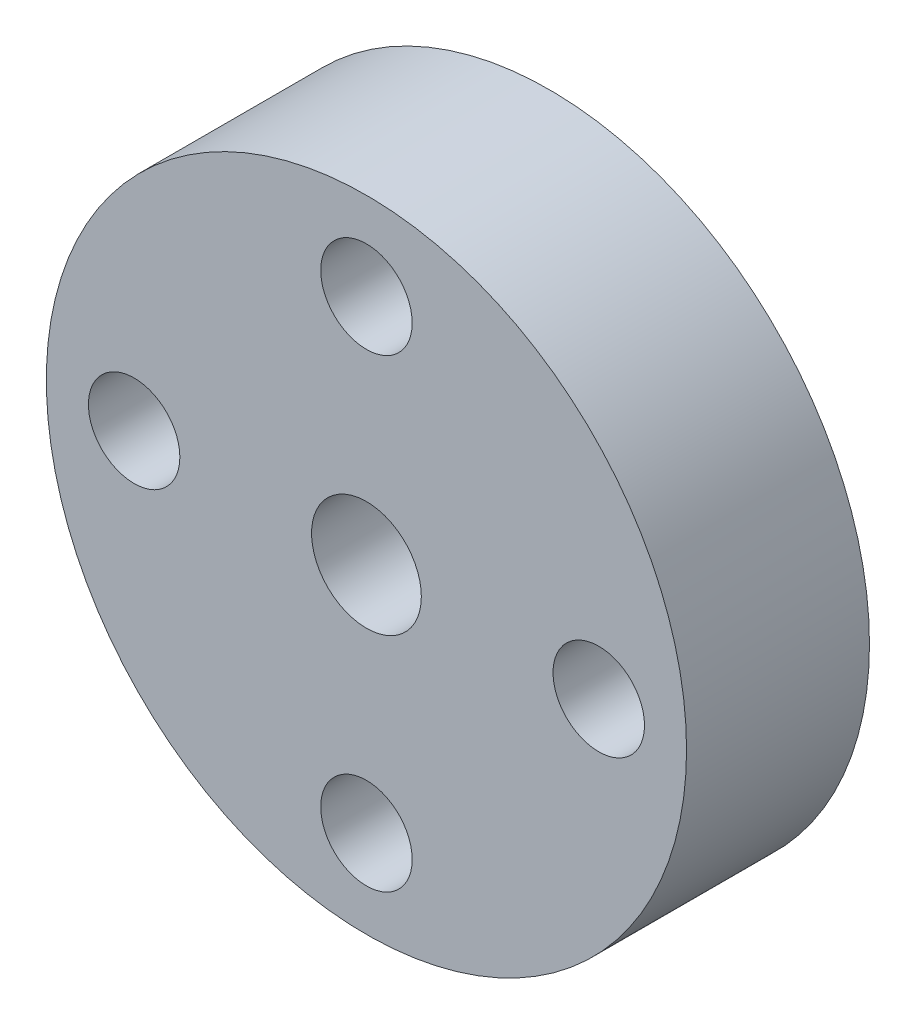
ISO-10303-21;
HEADER;
FILE_DESCRIPTION(('STEP AP214'),'2;1');
FILE_NAME('part.step','',(''),(''),'','','');
FILE_SCHEMA(('AUTOMOTIVE_DESIGN { 1 0 10303 214 1 1 1 1 }'));
ENDSEC;
DATA;
#1=APPLICATION_CONTEXT('core data for automotive mechanical design processes');
#2=APPLICATION_PROTOCOL_DEFINITION('international standard','automotive_design',2000,#1);
#3=PRODUCT_CONTEXT('',#1,'mechanical');
#4=PRODUCT('Part','Part','',(#3));
#5=PRODUCT_RELATED_PRODUCT_CATEGORY('part','',(#4));
#6=PRODUCT_DEFINITION_FORMATION('','',#4);
#7=PRODUCT_DEFINITION_CONTEXT('part definition',#1,'design');
#8=PRODUCT_DEFINITION('design','',#6,#7);
#9=PRODUCT_DEFINITION_SHAPE('','',#8);
#10=(LENGTH_UNIT() NAMED_UNIT(*) SI_UNIT(.MILLI.,.METRE.));
#11=(NAMED_UNIT(*) PLANE_ANGLE_UNIT() SI_UNIT($,.RADIAN.));
#12=(NAMED_UNIT(*) SI_UNIT($,.STERADIAN.) SOLID_ANGLE_UNIT());
#13=UNCERTAINTY_MEASURE_WITH_UNIT(LENGTH_MEASURE(1.E-05),#10,'distance_accuracy_value','');
#14=(GEOMETRIC_REPRESENTATION_CONTEXT(3) GLOBAL_UNCERTAINTY_ASSIGNED_CONTEXT((#13)) GLOBAL_UNIT_ASSIGNED_CONTEXT((#10,
#11,#12)) REPRESENTATION_CONTEXT('',''));
#15=CARTESIAN_POINT('',(0.,0.,0.));
#16=DIRECTION('',(0.,0.,1.));
#17=DIRECTION('',(1.,0.,0.));
#18=AXIS2_PLACEMENT_3D('',#15,#16,#17);
#19=CARTESIAN_POINT('',(0.,0.,5.));
#20=DIRECTION('',(0.,0.,-1.));
#21=DIRECTION('',(-1.,0.,0.));
#22=AXIS2_PLACEMENT_3D('',#19,#20,#21);
#23=CYLINDRICAL_SURFACE('',#22,8.75);
#24=CARTESIAN_POINT('',(0.,0.,5.));
#25=DIRECTION('',(0.,0.,1.));
#26=DIRECTION('',(1.,0.,0.));
#27=AXIS2_PLACEMENT_3D('',#24,#25,#26);
#28=CIRCLE('',#27,8.75);
#29=CARTESIAN_POINT('',(8.75,0.,5.));
#30=VERTEX_POINT('',#29);
#31=EDGE_CURVE('E10',#30,#30,#28,.T.);
#32=ORIENTED_EDGE('',*,*,#31,.F.);
#33=EDGE_LOOP('',(#32));
#34=FACE_BOUND('',#33,.T.);
#35=CARTESIAN_POINT('',(0.,0.,0.));
#36=DIRECTION('',(0.,0.,1.));
#37=DIRECTION('',(1.,0.,0.));
#38=AXIS2_PLACEMENT_3D('',#35,#36,#37);
#39=CIRCLE('',#38,8.75);
#40=CARTESIAN_POINT('',(8.75,0.,0.));
#41=VERTEX_POINT('',#40);
#42=EDGE_CURVE('E43',#41,#41,#39,.T.);
#43=ORIENTED_EDGE('',*,*,#42,.T.);
#44=EDGE_LOOP('',(#43));
#45=FACE_BOUND('',#44,.T.);
#46=ADVANCED_FACE('F40',(#34,#45),#23,.T.);
#47=CARTESIAN_POINT('',(0.,0.,5.));
#48=DIRECTION('',(0.,0.,1.));
#49=DIRECTION('',(1.,0.,0.));
#50=AXIS2_PLACEMENT_3D('',#47,#48,#49);
#51=PLANE('',#50);
#52=CARTESIAN_POINT('',(0.,0.,5.));
#53=DIRECTION('',(0.,0.,1.));
#54=DIRECTION('',(1.,0.,0.));
#55=AXIS2_PLACEMENT_3D('',#52,#53,#54);
#56=CIRCLE('',#55,1.5);
#57=CARTESIAN_POINT('',(1.5,0.,5.));
#58=VERTEX_POINT('',#57);
#59=EDGE_CURVE('E76',#58,#58,#56,.T.);
#60=ORIENTED_EDGE('',*,*,#59,.F.);
#61=EDGE_LOOP('',(#60));
#62=FACE_BOUND('',#61,.T.);
#63=CARTESIAN_POINT('',(0.,6.35,5.));
#64=DIRECTION('',(0.,0.,1.));
#65=DIRECTION('',(1.,0.,0.));
#66=AXIS2_PLACEMENT_3D('',#63,#64,#65);
#67=CIRCLE('',#66,1.25);
#68=CARTESIAN_POINT('',(1.25,6.35,5.));
#69=VERTEX_POINT('',#68);
#70=EDGE_CURVE('E72',#69,#69,#67,.T.);
#71=ORIENTED_EDGE('',*,*,#70,.F.);
#72=EDGE_LOOP('',(#71));
#73=FACE_BOUND('',#72,.T.);
#74=CARTESIAN_POINT('',(6.35000000000018,1.79311378806878E-13,5.));
#75=DIRECTION('',(0.,0.,1.));
#76=DIRECTION('',(1.,0.,0.));
#77=AXIS2_PLACEMENT_3D('',#74,#75,#76);
#78=CIRCLE('',#77,1.25);
#79=CARTESIAN_POINT('',(7.60000000000018,1.79311378806878E-13,5.));
#80=VERTEX_POINT('',#79);
#81=EDGE_CURVE('E66',#80,#80,#78,.T.);
#82=ORIENTED_EDGE('',*,*,#81,.F.);
#83=EDGE_LOOP('',(#82));
#84=FACE_BOUND('',#83,.T.);
#85=CARTESIAN_POINT('',(3.58622757613755E-13,-6.35,5.));
#86=DIRECTION('',(0.,0.,1.));
#87=DIRECTION('',(1.,0.,0.));
#88=AXIS2_PLACEMENT_3D('',#85,#86,#87);
#89=CIRCLE('',#88,1.25);
#90=CARTESIAN_POINT('',(1.25000000000036,-6.35,5.));
#91=VERTEX_POINT('',#90);
#92=EDGE_CURVE('E60',#91,#91,#89,.T.);
#93=ORIENTED_EDGE('',*,*,#92,.F.);
#94=EDGE_LOOP('',(#93));
#95=FACE_BOUND('',#94,.T.);
#96=CARTESIAN_POINT('',(-6.34999999999982,-1.78533728089419E-13,5.));
#97=DIRECTION('',(0.,0.,1.));
#98=DIRECTION('',(1.,0.,0.));
#99=AXIS2_PLACEMENT_3D('',#96,#97,#98);
#100=CIRCLE('',#99,1.25);
#101=CARTESIAN_POINT('',(-5.09999999999982,-1.78533728089419E-13,5.));
#102=VERTEX_POINT('',#101);
#103=EDGE_CURVE('E54',#102,#102,#100,.T.);
#104=ORIENTED_EDGE('',*,*,#103,.F.);
#105=EDGE_LOOP('',(#104));
#106=FACE_BOUND('',#105,.T.);
#107=ORIENTED_EDGE('',*,*,#31,.T.);
#108=EDGE_LOOP('',(#107));
#109=FACE_BOUND('',#108,.T.);
#110=ADVANCED_FACE('F92',(#62,#73,#84,#95,#106,#109),#51,.T.);
#111=CARTESIAN_POINT('',(0.,0.,0.));
#112=DIRECTION('',(0.,0.,1.));
#113=DIRECTION('',(1.,0.,0.));
#114=AXIS2_PLACEMENT_3D('',#111,#112,#113);
#115=PLANE('',#114);
#116=CARTESIAN_POINT('',(0.,0.,0.));
#117=DIRECTION('',(0.,0.,1.));
#118=DIRECTION('',(1.,0.,0.));
#119=AXIS2_PLACEMENT_3D('',#116,#117,#118);
#120=CIRCLE('',#119,1.5);
#121=CARTESIAN_POINT('',(1.5,0.,0.));
#122=VERTEX_POINT('',#121);
#123=EDGE_CURVE('E75',#122,#122,#120,.T.);
#124=ORIENTED_EDGE('',*,*,#123,.T.);
#125=EDGE_LOOP('',(#124));
#126=FACE_BOUND('',#125,.T.);
#127=CARTESIAN_POINT('',(0.,6.35,0.));
#128=DIRECTION('',(0.,0.,1.));
#129=DIRECTION('',(1.,0.,0.));
#130=AXIS2_PLACEMENT_3D('',#127,#128,#129);
#131=CIRCLE('',#130,1.25);
#132=CARTESIAN_POINT('',(1.25,6.35,0.));
#133=VERTEX_POINT('',#132);
#134=EDGE_CURVE('E69',#133,#133,#131,.T.);
#135=ORIENTED_EDGE('',*,*,#134,.T.);
#136=EDGE_LOOP('',(#135));
#137=FACE_BOUND('',#136,.T.);
#138=CARTESIAN_POINT('',(6.35000000000018,1.79311378806878E-13,0.));
#139=DIRECTION('',(0.,0.,1.));
#140=DIRECTION('',(1.,0.,0.));
#141=AXIS2_PLACEMENT_3D('',#138,#139,#140);
#142=CIRCLE('',#141,1.25);
#143=CARTESIAN_POINT('',(7.60000000000018,1.79311378806878E-13,0.));
#144=VERTEX_POINT('',#143);
#145=EDGE_CURVE('E63',#144,#144,#142,.T.);
#146=ORIENTED_EDGE('',*,*,#145,.T.);
#147=EDGE_LOOP('',(#146));
#148=FACE_BOUND('',#147,.T.);
#149=CARTESIAN_POINT('',(3.58622757613755E-13,-6.35,0.));
#150=DIRECTION('',(0.,0.,1.));
#151=DIRECTION('',(1.,0.,0.));
#152=AXIS2_PLACEMENT_3D('',#149,#150,#151);
#153=CIRCLE('',#152,1.25);
#154=CARTESIAN_POINT('',(1.25000000000036,-6.35,0.));
#155=VERTEX_POINT('',#154);
#156=EDGE_CURVE('E57',#155,#155,#153,.T.);
#157=ORIENTED_EDGE('',*,*,#156,.T.);
#158=EDGE_LOOP('',(#157));
#159=FACE_BOUND('',#158,.T.);
#160=CARTESIAN_POINT('',(-6.34999999999982,-1.78533728089419E-13,0.));
#161=DIRECTION('',(0.,0.,1.));
#162=DIRECTION('',(1.,0.,0.));
#163=AXIS2_PLACEMENT_3D('',#160,#161,#162);
#164=CIRCLE('',#163,1.25);
#165=CARTESIAN_POINT('',(-5.09999999999982,-1.78533728089419E-13,0.));
#166=VERTEX_POINT('',#165);
#167=EDGE_CURVE('E50',#166,#166,#164,.T.);
#168=ORIENTED_EDGE('',*,*,#167,.T.);
#169=EDGE_LOOP('',(#168));
#170=FACE_BOUND('',#169,.T.);
#171=ORIENTED_EDGE('',*,*,#42,.F.);
#172=EDGE_LOOP('',(#171));
#173=FACE_BOUND('',#172,.T.);
#174=ADVANCED_FACE('F82',(#126,#137,#148,#159,#170,#173),#115,.F.);
#175=CARTESIAN_POINT('',(-6.34999999999982,-1.78533728089419E-13,5.));
#176=DIRECTION('',(0.,0.,1.));
#177=DIRECTION('',(1.,0.,0.));
#178=AXIS2_PLACEMENT_3D('',#175,#176,#177);
#179=CYLINDRICAL_SURFACE('',#178,1.25);
#180=ORIENTED_EDGE('',*,*,#167,.F.);
#181=EDGE_LOOP('',(#180));
#182=FACE_BOUND('',#181,.T.);
#183=ORIENTED_EDGE('',*,*,#103,.T.);
#184=EDGE_LOOP('',(#183));
#185=FACE_BOUND('',#184,.T.);
#186=ADVANCED_FACE('F104',(#182,#185),#179,.F.);
#187=CARTESIAN_POINT('',(3.58622757613755E-13,-6.35,5.));
#188=DIRECTION('',(0.,0.,1.));
#189=DIRECTION('',(1.,0.,0.));
#190=AXIS2_PLACEMENT_3D('',#187,#188,#189);
#191=CYLINDRICAL_SURFACE('',#190,1.25);
#192=ORIENTED_EDGE('',*,*,#156,.F.);
#193=EDGE_LOOP('',(#192));
#194=FACE_BOUND('',#193,.T.);
#195=ORIENTED_EDGE('',*,*,#92,.T.);
#196=EDGE_LOOP('',(#195));
#197=FACE_BOUND('',#196,.T.);
#198=ADVANCED_FACE('F106',(#194,#197),#191,.F.);
#199=CARTESIAN_POINT('',(6.35000000000018,1.79311378806878E-13,5.));
#200=DIRECTION('',(0.,0.,1.));
#201=DIRECTION('',(1.,0.,0.));
#202=AXIS2_PLACEMENT_3D('',#199,#200,#201);
#203=CYLINDRICAL_SURFACE('',#202,1.25);
#204=ORIENTED_EDGE('',*,*,#145,.F.);
#205=EDGE_LOOP('',(#204));
#206=FACE_BOUND('',#205,.T.);
#207=ORIENTED_EDGE('',*,*,#81,.T.);
#208=EDGE_LOOP('',(#207));
#209=FACE_BOUND('',#208,.T.);
#210=ADVANCED_FACE('F113',(#206,#209),#203,.F.);
#211=CARTESIAN_POINT('',(0.,6.35,5.));
#212=DIRECTION('',(0.,0.,1.));
#213=DIRECTION('',(1.,0.,0.));
#214=AXIS2_PLACEMENT_3D('',#211,#212,#213);
#215=CYLINDRICAL_SURFACE('',#214,1.25);
#216=ORIENTED_EDGE('',*,*,#134,.F.);
#217=EDGE_LOOP('',(#216));
#218=FACE_BOUND('',#217,.T.);
#219=ORIENTED_EDGE('',*,*,#70,.T.);
#220=EDGE_LOOP('',(#219));
#221=FACE_BOUND('',#220,.T.);
#222=ADVANCED_FACE('F88',(#218,#221),#215,.F.);
#223=CARTESIAN_POINT('',(0.,0.,0.));
#224=DIRECTION('',(0.,0.,1.));
#225=DIRECTION('',(1.,0.,0.));
#226=AXIS2_PLACEMENT_3D('',#223,#224,#225);
#227=CYLINDRICAL_SURFACE('',#226,1.5);
#228=ORIENTED_EDGE('',*,*,#123,.F.);
#229=EDGE_LOOP('',(#228));
#230=FACE_BOUND('',#229,.T.);
#231=ORIENTED_EDGE('',*,*,#59,.T.);
#232=EDGE_LOOP('',(#231));
#233=FACE_BOUND('',#232,.T.);
#234=ADVANCED_FACE('F85',(#230,#233),#227,.F.);
#235=CLOSED_SHELL('',(#46,#110,#174,#186,#198,#210,#222,#234));
#236=MANIFOLD_SOLID_BREP('B2',#235);
#237=ADVANCED_BREP_SHAPE_REPRESENTATION('',(#18,#236),#14);
#238=SHAPE_DEFINITION_REPRESENTATION(#9,#237);
ENDSEC;
END-ISO-10303-21;
